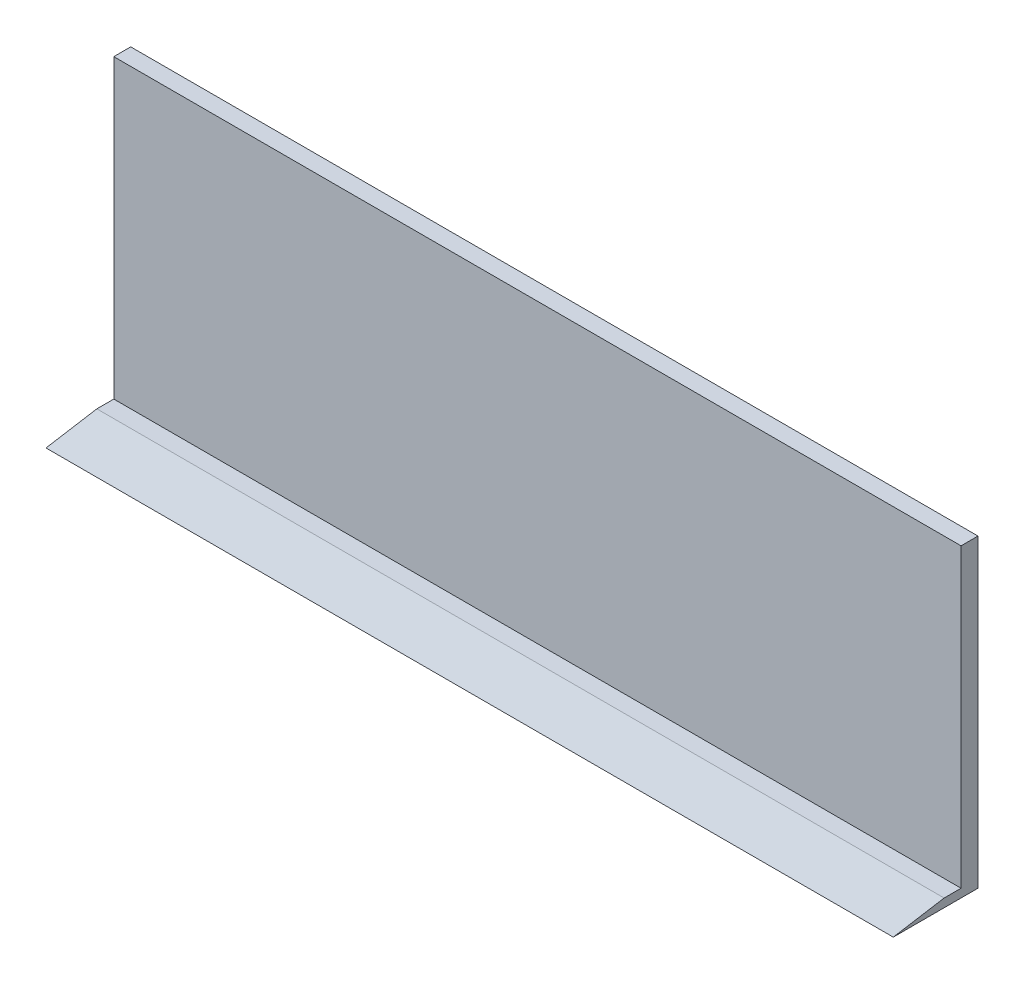
ISO-10303-21;
HEADER;
FILE_DESCRIPTION(('STEP AP214'),'2;1');
FILE_NAME('part.step','',(''),(''),'','','');
FILE_SCHEMA(('AUTOMOTIVE_DESIGN { 1 0 10303 214 1 1 1 1 }'));
ENDSEC;
DATA;
#1=APPLICATION_CONTEXT('core data for automotive mechanical design processes');
#2=APPLICATION_PROTOCOL_DEFINITION('international standard','automotive_design',2000,#1);
#3=PRODUCT_CONTEXT('',#1,'mechanical');
#4=PRODUCT('Part','Part','',(#3));
#5=PRODUCT_RELATED_PRODUCT_CATEGORY('part','',(#4));
#6=PRODUCT_DEFINITION_FORMATION('','',#4);
#7=PRODUCT_DEFINITION_CONTEXT('part definition',#1,'design');
#8=PRODUCT_DEFINITION('design','',#6,#7);
#9=PRODUCT_DEFINITION_SHAPE('','',#8);
#10=(LENGTH_UNIT() NAMED_UNIT(*) SI_UNIT(.MILLI.,.METRE.));
#11=(NAMED_UNIT(*) PLANE_ANGLE_UNIT() SI_UNIT($,.RADIAN.));
#12=(NAMED_UNIT(*) SI_UNIT($,.STERADIAN.) SOLID_ANGLE_UNIT());
#13=UNCERTAINTY_MEASURE_WITH_UNIT(LENGTH_MEASURE(1.E-05),#10,'distance_accuracy_value','');
#14=(GEOMETRIC_REPRESENTATION_CONTEXT(3) GLOBAL_UNCERTAINTY_ASSIGNED_CONTEXT((#13)) GLOBAL_UNIT_ASSIGNED_CONTEXT((#10,
#11,#12)) REPRESENTATION_CONTEXT('',''));
#15=CARTESIAN_POINT('',(0.,0.,0.));
#16=DIRECTION('',(0.,0.,1.));
#17=DIRECTION('',(1.,0.,0.));
#18=AXIS2_PLACEMENT_3D('',#15,#16,#17);
#19=CARTESIAN_POINT('',(0.,0.,5.));
#20=DIRECTION('',(0.,0.,1.));
#21=DIRECTION('',(1.,0.,0.));
#22=AXIS2_PLACEMENT_3D('',#19,#20,#21);
#23=PLANE('',#22);
#24=DIRECTION('',(0.,-1.,0.));
#25=VECTOR('',#24,1.);
#26=CARTESIAN_POINT('',(-250.,0.,5.));
#27=LINE('',#26,#25);
#28=CARTESIAN_POINT('',(-250.,90.,5.));
#29=VERTEX_POINT('',#28);
#30=CARTESIAN_POINT('',(-250.,2.5,5.));
#31=VERTEX_POINT('',#30);
#32=EDGE_CURVE('E101',#29,#31,#27,.T.);
#33=ORIENTED_EDGE('',*,*,#32,.T.);
#34=DIRECTION('',(1.,0.,0.));
#35=VECTOR('',#34,1.);
#36=CARTESIAN_POINT('',(-250.,2.5,5.));
#37=LINE('',#36,#35);
#38=CARTESIAN_POINT('',(0.,2.5,5.));
#39=VERTEX_POINT('',#38);
#40=EDGE_CURVE('E127',#31,#39,#37,.T.);
#41=ORIENTED_EDGE('',*,*,#40,.T.);
#42=DIRECTION('',(0.,1.,0.));
#43=VECTOR('',#42,1.);
#44=CARTESIAN_POINT('',(0.,0.,5.));
#45=LINE('',#44,#43);
#46=CARTESIAN_POINT('',(0.,90.,5.));
#47=VERTEX_POINT('',#46);
#48=EDGE_CURVE('E91',#39,#47,#45,.T.);
#49=ORIENTED_EDGE('',*,*,#48,.T.);
#50=DIRECTION('',(-1.,0.,0.));
#51=VECTOR('',#50,1.);
#52=CARTESIAN_POINT('',(0.,90.,5.));
#53=LINE('',#52,#51);
#54=EDGE_CURVE('E59',#47,#29,#53,.T.);
#55=ORIENTED_EDGE('',*,*,#54,.T.);
#56=EDGE_LOOP('',(#33,#41,#49,#55));
#57=FACE_BOUND('',#56,.T.);
#58=ADVANCED_FACE('F33',(#57),#23,.T.);
#59=CARTESIAN_POINT('',(0.,0.,5.));
#60=DIRECTION('',(-1.,0.,0.));
#61=DIRECTION('',(0.,-1.,0.));
#62=AXIS2_PLACEMENT_3D('',#59,#60,#61);
#63=PLANE('',#62);
#64=DIRECTION('',(0.,1.,0.));
#65=VECTOR('',#64,1.);
#66=CARTESIAN_POINT('',(0.,0.,0.));
#67=LINE('',#66,#65);
#68=CARTESIAN_POINT('',(0.,0.,0.));
#69=VERTEX_POINT('',#68);
#70=CARTESIAN_POINT('',(0.,90.,0.));
#71=VERTEX_POINT('',#70);
#72=EDGE_CURVE('E98',#69,#71,#67,.T.);
#73=ORIENTED_EDGE('',*,*,#72,.T.);
#74=DIRECTION('',(0.,0.,-1.));
#75=VECTOR('',#74,1.);
#76=CARTESIAN_POINT('',(0.,90.,5.));
#77=LINE('',#76,#75);
#78=EDGE_CURVE('E11',#47,#71,#77,.T.);
#79=ORIENTED_EDGE('',*,*,#78,.F.);
#80=ORIENTED_EDGE('',*,*,#48,.F.);
#81=DIRECTION('',(0.,0.,1.));
#82=VECTOR('',#81,1.);
#83=CARTESIAN_POINT('',(0.,2.5,5.));
#84=LINE('',#83,#82);
#85=CARTESIAN_POINT('',(0.,2.5,10.));
#86=VERTEX_POINT('',#85);
#87=EDGE_CURVE('E50',#39,#86,#84,.T.);
#88=ORIENTED_EDGE('',*,*,#87,.T.);
#89=DIRECTION('',(0.,-0.164398987305357,0.986393923832144));
#90=VECTOR('',#89,1.);
#91=CARTESIAN_POINT('',(0.,2.5,10.));
#92=LINE('',#91,#90);
#93=CARTESIAN_POINT('',(0.,0.,25.));
#94=VERTEX_POINT('',#93);
#95=EDGE_CURVE('E100',#86,#94,#92,.T.);
#96=ORIENTED_EDGE('',*,*,#95,.T.);
#97=DIRECTION('',(0.,0.,-1.));
#98=VECTOR('',#97,1.);
#99=CARTESIAN_POINT('',(0.,0.,5.));
#100=LINE('',#99,#98);
#101=EDGE_CURVE('E84',#94,#69,#100,.T.);
#102=ORIENTED_EDGE('',*,*,#101,.T.);
#103=EDGE_LOOP('',(#73,#79,#80,#88,#96,#102));
#104=FACE_BOUND('',#103,.T.);
#105=ADVANCED_FACE('F35',(#104),#63,.F.);
#106=CARTESIAN_POINT('',(0.,90.,5.));
#107=DIRECTION('',(0.,-1.,0.));
#108=DIRECTION('',(1.,0.,0.));
#109=AXIS2_PLACEMENT_3D('',#106,#107,#108);
#110=PLANE('',#109);
#111=DIRECTION('',(-1.,0.,0.));
#112=VECTOR('',#111,1.);
#113=CARTESIAN_POINT('',(0.,90.,0.));
#114=LINE('',#113,#112);
#115=CARTESIAN_POINT('',(-250.,90.,0.));
#116=VERTEX_POINT('',#115);
#117=EDGE_CURVE('E104',#71,#116,#114,.T.);
#118=ORIENTED_EDGE('',*,*,#117,.T.);
#119=DIRECTION('',(0.,0.,-1.));
#120=VECTOR('',#119,1.);
#121=CARTESIAN_POINT('',(-250.,90.,5.));
#122=LINE('',#121,#120);
#123=EDGE_CURVE('E42',#29,#116,#122,.T.);
#124=ORIENTED_EDGE('',*,*,#123,.F.);
#125=ORIENTED_EDGE('',*,*,#54,.F.);
#126=ORIENTED_EDGE('',*,*,#78,.T.);
#127=EDGE_LOOP('',(#118,#124,#125,#126));
#128=FACE_BOUND('',#127,.T.);
#129=ADVANCED_FACE('F165',(#128),#110,.F.);
#130=CARTESIAN_POINT('',(-250.,0.,5.));
#131=DIRECTION('',(1.,0.,0.));
#132=DIRECTION('',(0.,0.,-1.));
#133=AXIS2_PLACEMENT_3D('',#130,#131,#132);
#134=PLANE('',#133);
#135=DIRECTION('',(0.,-1.,0.));
#136=VECTOR('',#135,1.);
#137=CARTESIAN_POINT('',(-250.,0.,0.));
#138=LINE('',#137,#136);
#139=CARTESIAN_POINT('',(-250.,0.,0.));
#140=VERTEX_POINT('',#139);
#141=EDGE_CURVE('E92',#116,#140,#138,.T.);
#142=ORIENTED_EDGE('',*,*,#141,.T.);
#143=DIRECTION('',(0.,0.,-1.));
#144=VECTOR('',#143,1.);
#145=CARTESIAN_POINT('',(-250.,0.,5.));
#146=LINE('',#145,#144);
#147=CARTESIAN_POINT('',(-250.,0.,25.));
#148=VERTEX_POINT('',#147);
#149=EDGE_CURVE('E87',#148,#140,#146,.T.);
#150=ORIENTED_EDGE('',*,*,#149,.F.);
#151=DIRECTION('',(0.,-0.164398987305357,0.986393923832144));
#152=VECTOR('',#151,1.);
#153=CARTESIAN_POINT('',(-250.,2.5,10.));
#154=LINE('',#153,#152);
#155=CARTESIAN_POINT('',(-250.,2.5,10.));
#156=VERTEX_POINT('',#155);
#157=EDGE_CURVE('E138',#156,#148,#154,.T.);
#158=ORIENTED_EDGE('',*,*,#157,.F.);
#159=DIRECTION('',(0.,0.,1.));
#160=VECTOR('',#159,1.);
#161=CARTESIAN_POINT('',(-250.,2.5,5.));
#162=LINE('',#161,#160);
#163=EDGE_CURVE('E136',#31,#156,#162,.T.);
#164=ORIENTED_EDGE('',*,*,#163,.F.);
#165=ORIENTED_EDGE('',*,*,#32,.F.);
#166=ORIENTED_EDGE('',*,*,#123,.T.);
#167=EDGE_LOOP('',(#142,#150,#158,#164,#165,#166));
#168=FACE_BOUND('',#167,.T.);
#169=ADVANCED_FACE('F133',(#168),#134,.F.);
#170=CARTESIAN_POINT('',(0.,0.,5.));
#171=DIRECTION('',(0.,1.,0.));
#172=DIRECTION('',(-1.,0.,0.));
#173=AXIS2_PLACEMENT_3D('',#170,#171,#172);
#174=PLANE('',#173);
#175=DIRECTION('',(1.,0.,0.));
#176=VECTOR('',#175,1.);
#177=CARTESIAN_POINT('',(0.,0.,0.));
#178=LINE('',#177,#176);
#179=EDGE_CURVE('E79',#140,#69,#178,.T.);
#180=ORIENTED_EDGE('',*,*,#179,.T.);
#181=ORIENTED_EDGE('',*,*,#101,.F.);
#182=DIRECTION('',(1.,0.,0.));
#183=VECTOR('',#182,1.);
#184=CARTESIAN_POINT('',(-250.,0.,25.));
#185=LINE('',#184,#183);
#186=EDGE_CURVE('E105',#148,#94,#185,.T.);
#187=ORIENTED_EDGE('',*,*,#186,.F.);
#188=ORIENTED_EDGE('',*,*,#149,.T.);
#189=EDGE_LOOP('',(#180,#181,#187,#188));
#190=FACE_BOUND('',#189,.T.);
#191=ADVANCED_FACE('F81',(#190),#174,.F.);
#192=CARTESIAN_POINT('',(0.,0.,0.));
#193=DIRECTION('',(0.,0.,1.));
#194=DIRECTION('',(1.,0.,0.));
#195=AXIS2_PLACEMENT_3D('',#192,#193,#194);
#196=PLANE('',#195);
#197=ORIENTED_EDGE('',*,*,#72,.F.);
#198=ORIENTED_EDGE('',*,*,#179,.F.);
#199=ORIENTED_EDGE('',*,*,#141,.F.);
#200=ORIENTED_EDGE('',*,*,#117,.F.);
#201=EDGE_LOOP('',(#197,#198,#199,#200));
#202=FACE_BOUND('',#201,.T.);
#203=ADVANCED_FACE('F103',(#202),#196,.F.);
#204=CARTESIAN_POINT('',(-250.,2.5,10.));
#205=DIRECTION('',(0.,0.986393923832144,0.164398987305357));
#206=DIRECTION('',(0.,-0.164398987305357,0.986393923832144));
#207=AXIS2_PLACEMENT_3D('',#204,#205,#206);
#208=PLANE('',#207);
#209=ORIENTED_EDGE('',*,*,#95,.F.);
#210=DIRECTION('',(1.,0.,0.));
#211=VECTOR('',#210,1.);
#212=CARTESIAN_POINT('',(-250.,2.5,10.));
#213=LINE('',#212,#211);
#214=EDGE_CURVE('E108',#156,#86,#213,.T.);
#215=ORIENTED_EDGE('',*,*,#214,.F.);
#216=ORIENTED_EDGE('',*,*,#157,.T.);
#217=ORIENTED_EDGE('',*,*,#186,.T.);
#218=EDGE_LOOP('',(#209,#215,#216,#217));
#219=FACE_BOUND('',#218,.T.);
#220=ADVANCED_FACE('F150',(#219),#208,.T.);
#221=CARTESIAN_POINT('',(-250.,2.5,5.));
#222=DIRECTION('',(0.,1.,0.));
#223=DIRECTION('',(0.,0.,1.));
#224=AXIS2_PLACEMENT_3D('',#221,#222,#223);
#225=PLANE('',#224);
#226=ORIENTED_EDGE('',*,*,#87,.F.);
#227=ORIENTED_EDGE('',*,*,#40,.F.);
#228=ORIENTED_EDGE('',*,*,#163,.T.);
#229=ORIENTED_EDGE('',*,*,#214,.T.);
#230=EDGE_LOOP('',(#226,#227,#228,#229));
#231=FACE_BOUND('',#230,.T.);
#232=ADVANCED_FACE('F152',(#231),#225,.T.);
#233=CLOSED_SHELL('',(#58,#105,#129,#169,#191,#203,#220,#232));
#234=MANIFOLD_SOLID_BREP('B2',#233);
#235=ADVANCED_BREP_SHAPE_REPRESENTATION('',(#18,#234),#14);
#236=SHAPE_DEFINITION_REPRESENTATION(#9,#235);
ENDSEC;
END-ISO-10303-21;
